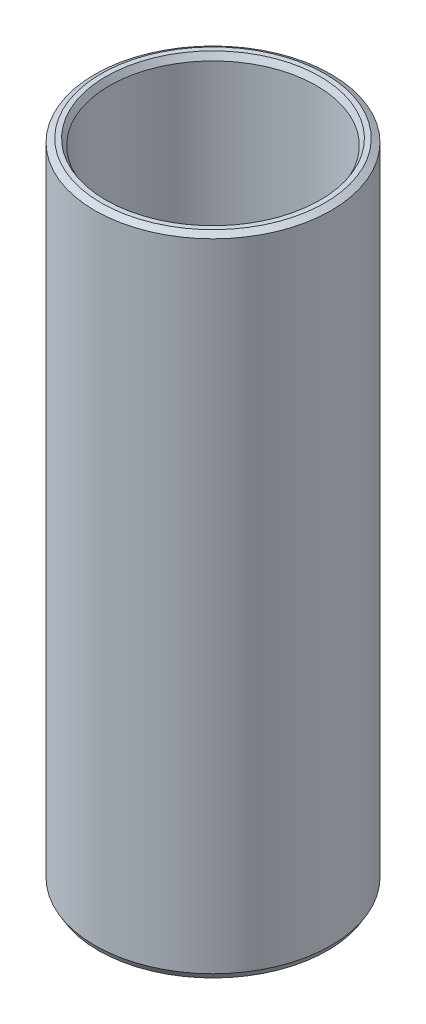
ISO-10303-21;
HEADER;
FILE_DESCRIPTION(('STEP AP214'),'2;1');
FILE_NAME('part.step','',(''),(''),'','','');
FILE_SCHEMA(('AUTOMOTIVE_DESIGN { 1 0 10303 214 1 1 1 1 }'));
ENDSEC;
DATA;
#1=APPLICATION_CONTEXT('core data for automotive mechanical design processes');
#2=APPLICATION_PROTOCOL_DEFINITION('international standard','automotive_design',2000,#1);
#3=PRODUCT_CONTEXT('',#1,'mechanical');
#4=PRODUCT('Part','Part','',(#3));
#5=PRODUCT_RELATED_PRODUCT_CATEGORY('part','',(#4));
#6=PRODUCT_DEFINITION_FORMATION('','',#4);
#7=PRODUCT_DEFINITION_CONTEXT('part definition',#1,'design');
#8=PRODUCT_DEFINITION('design','',#6,#7);
#9=PRODUCT_DEFINITION_SHAPE('','',#8);
#10=(LENGTH_UNIT() NAMED_UNIT(*) SI_UNIT(.MILLI.,.METRE.));
#11=(NAMED_UNIT(*) PLANE_ANGLE_UNIT() SI_UNIT($,.RADIAN.));
#12=(NAMED_UNIT(*) SI_UNIT($,.STERADIAN.) SOLID_ANGLE_UNIT());
#13=UNCERTAINTY_MEASURE_WITH_UNIT(LENGTH_MEASURE(1.E-05),#10,'distance_accuracy_value','');
#14=(GEOMETRIC_REPRESENTATION_CONTEXT(3) GLOBAL_UNCERTAINTY_ASSIGNED_CONTEXT((#13)) GLOBAL_UNIT_ASSIGNED_CONTEXT((#10,
#11,#12)) REPRESENTATION_CONTEXT('',''));
#15=CARTESIAN_POINT('',(0.,0.,0.));
#16=DIRECTION('',(0.,0.,1.));
#17=DIRECTION('',(1.,0.,0.));
#18=AXIS2_PLACEMENT_3D('',#15,#16,#17);
#19=CARTESIAN_POINT('',(0.,259.943372334478,0.));
#20=DIRECTION('',(0.,-1.,0.));
#21=DIRECTION('',(0.,0.,-1.));
#22=AXIS2_PLACEMENT_3D('',#19,#20,#21);
#23=CYLINDRICAL_SURFACE('',#22,47.5);
#24=CARTESIAN_POINT('',(0.,2.48254721027419,0.));
#25=DIRECTION('',(0.,1.,0.));
#26=DIRECTION('',(0.,0.,1.));
#27=AXIS2_PLACEMENT_3D('',#24,#25,#26);
#28=CIRCLE('',#27,47.5);
#29=CARTESIAN_POINT('',(0.,2.48254721027419,47.5));
#30=VERTEX_POINT('',#29);
#31=EDGE_CURVE('E10',#30,#30,#28,.T.);
#32=ORIENTED_EDGE('',*,*,#31,.T.);
#33=EDGE_LOOP('',(#32));
#34=FACE_BOUND('',#33,.T.);
#35=CARTESIAN_POINT('',(0.,258.510073034351,0.));
#36=DIRECTION('',(0.,1.,0.));
#37=DIRECTION('',(0.,0.,1.));
#38=AXIS2_PLACEMENT_3D('',#35,#36,#37);
#39=CIRCLE('',#38,47.5);
#40=CARTESIAN_POINT('',(0.,258.510073034351,47.5));
#41=VERTEX_POINT('',#40);
#42=EDGE_CURVE('E50',#41,#41,#39,.F.);
#43=ORIENTED_EDGE('',*,*,#42,.T.);
#44=EDGE_LOOP('',(#43));
#45=FACE_BOUND('',#44,.T.);
#46=ADVANCED_FACE('F39',(#34,#45),#23,.T.);
#47=CARTESIAN_POINT('',(0.,259.943372334478,0.));
#48=DIRECTION('',(0.,1.,0.));
#49=DIRECTION('',(0.,0.,1.));
#50=AXIS2_PLACEMENT_3D('',#47,#48,#49);
#51=PLANE('',#50);
#52=CARTESIAN_POINT('',(0.,259.943372334478,0.));
#53=DIRECTION('',(0.,1.,0.));
#54=DIRECTION('',(0.,0.,1.));
#55=AXIS2_PLACEMENT_3D('',#52,#53,#54);
#56=CIRCLE('',#55,43.0796556655177);
#57=CARTESIAN_POINT('',(0.,259.943372334478,43.0796556655177));
#58=VERTEX_POINT('',#57);
#59=EDGE_CURVE('E58',#58,#58,#56,.F.);
#60=ORIENTED_EDGE('',*,*,#59,.T.);
#61=EDGE_LOOP('',(#60));
#62=FACE_BOUND('',#61,.T.);
#63=CARTESIAN_POINT('',(0.,259.943372334478,0.));
#64=DIRECTION('',(0.,1.,0.));
#65=DIRECTION('',(0.,0.,1.));
#66=AXIS2_PLACEMENT_3D('',#63,#64,#65);
#67=CIRCLE('',#66,45.0174527897259);
#68=CARTESIAN_POINT('',(0.,259.943372334478,45.0174527897259));
#69=VERTEX_POINT('',#68);
#70=EDGE_CURVE('E61',#69,#69,#67,.T.);
#71=ORIENTED_EDGE('',*,*,#70,.T.);
#72=EDGE_LOOP('',(#71));
#73=FACE_BOUND('',#72,.T.);
#74=ADVANCED_FACE('F88',(#62,#73),#51,.T.);
#75=CARTESIAN_POINT('',(0.,0.,0.));
#76=DIRECTION('',(0.,1.,0.));
#77=DIRECTION('',(0.,0.,1.));
#78=AXIS2_PLACEMENT_3D('',#75,#76,#77);
#79=PLANE('',#78);
#80=CARTESIAN_POINT('',(0.,0.,0.));
#81=DIRECTION('',(0.,1.,0.));
#82=DIRECTION('',(0.,0.,1.));
#83=AXIS2_PLACEMENT_3D('',#80,#81,#82);
#84=CIRCLE('',#83,44.1289035756643);
#85=CARTESIAN_POINT('',(0.,0.,44.1289035756643));
#86=VERTEX_POINT('',#85);
#87=EDGE_CURVE('E51',#86,#86,#84,.T.);
#88=ORIENTED_EDGE('',*,*,#87,.T.);
#89=EDGE_LOOP('',(#88));
#90=FACE_BOUND('',#89,.T.);
#91=CARTESIAN_POINT('',(0.,0.,0.));
#92=DIRECTION('',(0.,1.,0.));
#93=DIRECTION('',(0.,0.,1.));
#94=AXIS2_PLACEMENT_3D('',#91,#92,#93);
#95=CIRCLE('',#94,46.0667006998722);
#96=CARTESIAN_POINT('',(0.,0.,46.0667006998722));
#97=VERTEX_POINT('',#96);
#98=EDGE_CURVE('E54',#97,#97,#95,.F.);
#99=ORIENTED_EDGE('',*,*,#98,.T.);
#100=EDGE_LOOP('',(#99));
#101=FACE_BOUND('',#100,.T.);
#102=ADVANCED_FACE('F83',(#90,#101),#79,.F.);
#103=CARTESIAN_POINT('',(0.,259.943372334478,0.));
#104=DIRECTION('',(0.,-1.,0.));
#105=DIRECTION('',(0.,0.,-1.));
#106=AXIS2_PLACEMENT_3D('',#103,#104,#105);
#107=CYLINDRICAL_SURFACE('',#106,41.6463563653901);
#108=CARTESIAN_POINT('',(0.,257.460825124204,0.));
#109=DIRECTION('',(0.,1.,0.));
#110=DIRECTION('',(0.,0.,1.));
#111=AXIS2_PLACEMENT_3D('',#108,#109,#110);
#112=CIRCLE('',#111,41.6463563653901);
#113=CARTESIAN_POINT('',(0.,257.460825124204,41.6463563653901));
#114=VERTEX_POINT('',#113);
#115=EDGE_CURVE('E67',#114,#114,#112,.T.);
#116=ORIENTED_EDGE('',*,*,#115,.T.);
#117=EDGE_LOOP('',(#116));
#118=FACE_BOUND('',#117,.T.);
#119=CARTESIAN_POINT('',(0.,1.43329930012775,0.));
#120=DIRECTION('',(0.,1.,0.));
#121=DIRECTION('',(0.,0.,1.));
#122=AXIS2_PLACEMENT_3D('',#119,#120,#121);
#123=CIRCLE('',#122,41.6463563653901);
#124=CARTESIAN_POINT('',(0.,1.43329930012775,41.6463563653901));
#125=VERTEX_POINT('',#124);
#126=EDGE_CURVE('E69',#125,#125,#123,.F.);
#127=ORIENTED_EDGE('',*,*,#126,.T.);
#128=EDGE_LOOP('',(#127));
#129=FACE_BOUND('',#128,.T.);
#130=ADVANCED_FACE('F71',(#118,#129),#107,.F.);
#131=CARTESIAN_POINT('',(0.,257.460825124204,0.));
#132=DIRECTION('',(0.,1.,0.));
#133=DIRECTION('',(0.,0.,1.));
#134=AXIS2_PLACEMENT_3D('',#131,#132,#133);
#135=CONICAL_SURFACE('',#134,41.6463563653901,0.523598775598308);
#136=ORIENTED_EDGE('',*,*,#59,.F.);
#137=EDGE_LOOP('',(#136));
#138=FACE_BOUND('',#137,.T.);
#139=ORIENTED_EDGE('',*,*,#115,.F.);
#140=EDGE_LOOP('',(#139));
#141=FACE_BOUND('',#140,.T.);
#142=ADVANCED_FACE('F77',(#138,#141),#135,.F.);
#143=CARTESIAN_POINT('',(0.,0.,0.));
#144=DIRECTION('',(0.,-1.,0.));
#145=DIRECTION('',(0.,0.,-1.));
#146=AXIS2_PLACEMENT_3D('',#143,#144,#145);
#147=CONICAL_SURFACE('',#146,44.1289035756643,1.0471975511966);
#148=ORIENTED_EDGE('',*,*,#126,.F.);
#149=EDGE_LOOP('',(#148));
#150=FACE_BOUND('',#149,.T.);
#151=ORIENTED_EDGE('',*,*,#87,.F.);
#152=EDGE_LOOP('',(#151));
#153=FACE_BOUND('',#152,.T.);
#154=ADVANCED_FACE('F73',(#150,#153),#147,.F.);
#155=CARTESIAN_POINT('',(0.,2.48254721027419,0.));
#156=DIRECTION('',(0.,1.,0.));
#157=DIRECTION('',(0.,0.,1.));
#158=AXIS2_PLACEMENT_3D('',#155,#156,#157);
#159=CONICAL_SURFACE('',#158,47.5,0.5235987755983);
#160=ORIENTED_EDGE('',*,*,#98,.F.);
#161=EDGE_LOOP('',(#160));
#162=FACE_BOUND('',#161,.T.);
#163=ORIENTED_EDGE('',*,*,#31,.F.);
#164=EDGE_LOOP('',(#163));
#165=FACE_BOUND('',#164,.T.);
#166=ADVANCED_FACE('F76',(#162,#165),#159,.T.);
#167=CARTESIAN_POINT('',(0.,259.943372334478,0.));
#168=DIRECTION('',(0.,-1.,0.));
#169=DIRECTION('',(0.,0.,-1.));
#170=AXIS2_PLACEMENT_3D('',#167,#168,#169);
#171=CONICAL_SURFACE('',#170,45.0174527897259,1.04719755119659);
#172=ORIENTED_EDGE('',*,*,#42,.F.);
#173=EDGE_LOOP('',(#172));
#174=FACE_BOUND('',#173,.T.);
#175=ORIENTED_EDGE('',*,*,#70,.F.);
#176=EDGE_LOOP('',(#175));
#177=FACE_BOUND('',#176,.T.);
#178=ADVANCED_FACE('F45',(#174,#177),#171,.T.);
#179=CLOSED_SHELL('',(#46,#74,#102,#130,#142,#154,#166,#178));
#180=MANIFOLD_SOLID_BREP('B2',#179);
#181=ADVANCED_BREP_SHAPE_REPRESENTATION('',(#18,#180),#14);
#182=SHAPE_DEFINITION_REPRESENTATION(#9,#181);
ENDSEC;
END-ISO-10303-21;
